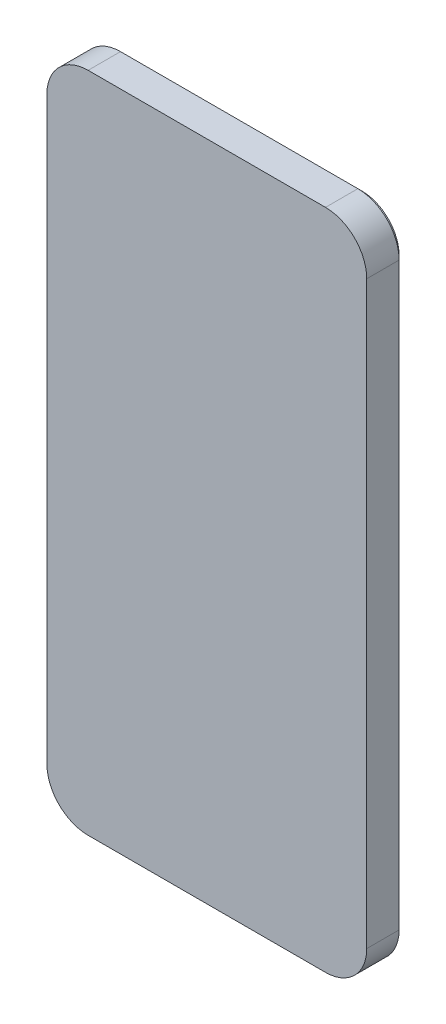
ISO-10303-21;
HEADER;
FILE_DESCRIPTION(('STEP AP214'),'2;1');
FILE_NAME('part.step','',(''),(''),'','','');
FILE_SCHEMA(('AUTOMOTIVE_DESIGN { 1 0 10303 214 1 1 1 1 }'));
ENDSEC;
DATA;
#1=APPLICATION_CONTEXT('core data for automotive mechanical design processes');
#2=APPLICATION_PROTOCOL_DEFINITION('international standard','automotive_design',2000,#1);
#3=PRODUCT_CONTEXT('',#1,'mechanical');
#4=PRODUCT('Part','Part','',(#3));
#5=PRODUCT_RELATED_PRODUCT_CATEGORY('part','',(#4));
#6=PRODUCT_DEFINITION_FORMATION('','',#4);
#7=PRODUCT_DEFINITION_CONTEXT('part definition',#1,'design');
#8=PRODUCT_DEFINITION('design','',#6,#7);
#9=PRODUCT_DEFINITION_SHAPE('','',#8);
#10=(LENGTH_UNIT() NAMED_UNIT(*) SI_UNIT(.MILLI.,.METRE.));
#11=(NAMED_UNIT(*) PLANE_ANGLE_UNIT() SI_UNIT($,.RADIAN.));
#12=(NAMED_UNIT(*) SI_UNIT($,.STERADIAN.) SOLID_ANGLE_UNIT());
#13=UNCERTAINTY_MEASURE_WITH_UNIT(LENGTH_MEASURE(1.E-05),#10,'distance_accuracy_value','');
#14=(GEOMETRIC_REPRESENTATION_CONTEXT(3) GLOBAL_UNCERTAINTY_ASSIGNED_CONTEXT((#13)) GLOBAL_UNIT_ASSIGNED_CONTEXT((#10,
#11,#12)) REPRESENTATION_CONTEXT('',''));
#15=CARTESIAN_POINT('',(0.,0.,0.));
#16=DIRECTION('',(0.,0.,1.));
#17=DIRECTION('',(1.,0.,0.));
#18=AXIS2_PLACEMENT_3D('',#15,#16,#17);
#19=CARTESIAN_POINT('',(42.7344857398579,18.2355513307985,-2.));
#20=DIRECTION('',(0.,0.,-1.));
#21=DIRECTION('',(-1.,0.,0.));
#22=AXIS2_PLACEMENT_3D('',#19,#20,#21);
#23=PLANE('',#22);
#24=DIRECTION('',(0.,1.,0.));
#25=VECTOR('',#24,1.);
#26=CARTESIAN_POINT('',(13.5344857398579,18.2355513307985,-2.));
#27=LINE('',#26,#25);
#28=CARTESIAN_POINT('',(13.5344857398577,-1.76444866920152,-2.));
#29=VERTEX_POINT('',#28);
#30=CARTESIAN_POINT('',(13.5344857398579,18.2355513307985,-2.));
#31=VERTEX_POINT('',#30);
#32=EDGE_CURVE('E361',#29,#31,#27,.T.);
#33=ORIENTED_EDGE('',*,*,#32,.T.);
#34=CARTESIAN_POINT('',(22.7344857398579,18.2355513307985,-2.));
#35=DIRECTION('',(0.,0.,-1.));
#36=DIRECTION('',(-1.,0.,0.));
#37=AXIS2_PLACEMENT_3D('',#34,#35,#36);
#38=CIRCLE('',#37,9.2);
#39=CARTESIAN_POINT('',(22.7344857398579,27.4355513307985,-2.));
#40=VERTEX_POINT('',#39);
#41=EDGE_CURVE('E363',#31,#40,#38,.T.);
#42=ORIENTED_EDGE('',*,*,#41,.T.);
#43=DIRECTION('',(1.,0.,0.));
#44=VECTOR('',#43,1.);
#45=CARTESIAN_POINT('',(42.7344857398579,27.4355513307985,-2.));
#46=LINE('',#45,#44);
#47=CARTESIAN_POINT('',(42.7344857398579,27.4355513307985,-2.));
#48=VERTEX_POINT('',#47);
#49=EDGE_CURVE('E349',#40,#48,#46,.T.);
#50=ORIENTED_EDGE('',*,*,#49,.T.);
#51=CARTESIAN_POINT('',(42.7344857398579,18.2355513307985,-2.));
#52=DIRECTION('',(0.,0.,-1.));
#53=DIRECTION('',(-1.,0.,0.));
#54=AXIS2_PLACEMENT_3D('',#51,#52,#53);
#55=CIRCLE('',#54,9.2);
#56=CARTESIAN_POINT('',(51.9344857398579,18.2355513307985,-2.));
#57=VERTEX_POINT('',#56);
#58=EDGE_CURVE('E351',#48,#57,#55,.T.);
#59=ORIENTED_EDGE('',*,*,#58,.T.);
#60=DIRECTION('',(0.,-1.,0.));
#61=VECTOR('',#60,1.);
#62=CARTESIAN_POINT('',(51.9344857398577,-1.7644486692015,-2.));
#63=LINE('',#62,#61);
#64=CARTESIAN_POINT('',(51.9344857398577,-1.76444866920151,-2.));
#65=VERTEX_POINT('',#64);
#66=EDGE_CURVE('E353',#57,#65,#63,.T.);
#67=ORIENTED_EDGE('',*,*,#66,.T.);
#68=CARTESIAN_POINT('',(42.7344857398577,-1.76444866920151,-2.));
#69=DIRECTION('',(0.,0.,-1.));
#70=DIRECTION('',(-1.,0.,0.));
#71=AXIS2_PLACEMENT_3D('',#68,#69,#70);
#72=CIRCLE('',#71,9.2);
#73=CARTESIAN_POINT('',(42.7344857398577,-10.9644486692015,-2.));
#74=VERTEX_POINT('',#73);
#75=EDGE_CURVE('E355',#65,#74,#72,.T.);
#76=ORIENTED_EDGE('',*,*,#75,.T.);
#77=DIRECTION('',(-1.,0.,0.));
#78=VECTOR('',#77,1.);
#79=CARTESIAN_POINT('',(22.7344857398577,-10.9644486692015,-2.));
#80=LINE('',#79,#78);
#81=CARTESIAN_POINT('',(22.7344857398577,-10.9644486692015,-2.));
#82=VERTEX_POINT('',#81);
#83=EDGE_CURVE('E357',#74,#82,#80,.T.);
#84=ORIENTED_EDGE('',*,*,#83,.T.);
#85=CARTESIAN_POINT('',(22.7344857398577,-1.76444866920151,-2.));
#86=DIRECTION('',(0.,0.,-1.));
#87=DIRECTION('',(-1.,0.,0.));
#88=AXIS2_PLACEMENT_3D('',#85,#86,#87);
#89=CIRCLE('',#88,9.2);
#90=EDGE_CURVE('E359',#82,#29,#89,.T.);
#91=ORIENTED_EDGE('',*,*,#90,.T.);
#92=EDGE_LOOP('',(#33,#42,#50,#59,#67,#76,#84,#91));
#93=FACE_BOUND('',#92,.T.);
#94=DIRECTION('',(0.,-1.,0.));
#95=VECTOR('',#94,1.);
#96=CARTESIAN_POINT('',(51.7344857398579,18.2355513307985,-2.));
#97=LINE('',#96,#95);
#98=CARTESIAN_POINT('',(51.7344857398579,18.2355513307985,-2.));
#99=VERTEX_POINT('',#98);
#100=CARTESIAN_POINT('',(51.7344857398577,-1.7644486692015,-2.));
#101=VERTEX_POINT('',#100);
#102=EDGE_CURVE('E404',#99,#101,#97,.T.);
#103=ORIENTED_EDGE('',*,*,#102,.F.);
#104=CARTESIAN_POINT('',(42.7344857398579,18.2355513307985,-2.));
#105=DIRECTION('',(0.,0.,-1.));
#106=DIRECTION('',(-1.,0.,0.));
#107=AXIS2_PLACEMENT_3D('',#104,#105,#106);
#108=CIRCLE('',#107,9.);
#109=CARTESIAN_POINT('',(42.7344857398579,27.2355513307985,-2.));
#110=VERTEX_POINT('',#109);
#111=EDGE_CURVE('E242',#110,#99,#108,.T.);
#112=ORIENTED_EDGE('',*,*,#111,.F.);
#113=DIRECTION('',(1.,0.,0.));
#114=VECTOR('',#113,1.);
#115=CARTESIAN_POINT('',(42.7344857398579,27.2355513307985,-2.));
#116=LINE('',#115,#114);
#117=CARTESIAN_POINT('',(22.7344857398579,27.2355513307985,-2.));
#118=VERTEX_POINT('',#117);
#119=EDGE_CURVE('E238',#118,#110,#116,.T.);
#120=ORIENTED_EDGE('',*,*,#119,.F.);
#121=CARTESIAN_POINT('',(22.7344857398579,18.2355513307985,-2.));
#122=DIRECTION('',(0.,0.,-1.));
#123=DIRECTION('',(-1.,0.,0.));
#124=AXIS2_PLACEMENT_3D('',#121,#122,#123);
#125=CIRCLE('',#124,8.99999999999998);
#126=CARTESIAN_POINT('',(13.7344857398579,18.2355513307985,-2.));
#127=VERTEX_POINT('',#126);
#128=EDGE_CURVE('E418',#127,#118,#125,.T.);
#129=ORIENTED_EDGE('',*,*,#128,.F.);
#130=DIRECTION('',(0.,1.,0.));
#131=VECTOR('',#130,1.);
#132=CARTESIAN_POINT('',(13.7344857398579,18.2355513307985,-2.));
#133=LINE('',#132,#131);
#134=CARTESIAN_POINT('',(13.7344857398579,-1.76444866920151,-2.));
#135=VERTEX_POINT('',#134);
#136=EDGE_CURVE('E416',#135,#127,#133,.T.);
#137=ORIENTED_EDGE('',*,*,#136,.F.);
#138=CARTESIAN_POINT('',(22.7344857398577,-1.76444866920151,-2.));
#139=DIRECTION('',(0.,0.,-1.));
#140=DIRECTION('',(-1.,0.,0.));
#141=AXIS2_PLACEMENT_3D('',#138,#139,#140);
#142=CIRCLE('',#141,8.99999999999987);
#143=CARTESIAN_POINT('',(22.7344857398577,-10.7644486692014,-2.));
#144=VERTEX_POINT('',#143);
#145=EDGE_CURVE('E414',#144,#135,#142,.T.);
#146=ORIENTED_EDGE('',*,*,#145,.F.);
#147=DIRECTION('',(-1.,0.,0.));
#148=VECTOR('',#147,1.);
#149=CARTESIAN_POINT('',(42.7344857398576,-10.7644486692015,-2.));
#150=LINE('',#149,#148);
#151=CARTESIAN_POINT('',(42.7344857398576,-10.7644486692015,-2.));
#152=VERTEX_POINT('',#151);
#153=EDGE_CURVE('E412',#152,#144,#150,.T.);
#154=ORIENTED_EDGE('',*,*,#153,.F.);
#155=CARTESIAN_POINT('',(42.7344857398576,-1.76444866920151,-2.));
#156=DIRECTION('',(0.,0.,-1.));
#157=DIRECTION('',(-1.,0.,0.));
#158=AXIS2_PLACEMENT_3D('',#155,#156,#157);
#159=CIRCLE('',#158,9.00000000000001);
#160=EDGE_CURVE('E406',#101,#152,#159,.T.);
#161=ORIENTED_EDGE('',*,*,#160,.F.);
#162=EDGE_LOOP('',(#103,#112,#120,#129,#137,#146,#154,#161));
#163=FACE_BOUND('',#162,.T.);
#164=ADVANCED_FACE('F33',(#93,#163),#23,.T.);
#165=CARTESIAN_POINT('',(0.,0.,0.));
#166=DIRECTION('',(0.,0.,1.));
#167=DIRECTION('',(1.,0.,0.));
#168=AXIS2_PLACEMENT_3D('',#165,#166,#167);
#169=PLANE('',#168);
#170=DIRECTION('',(0.,1.,0.));
#171=VECTOR('',#170,1.);
#172=CARTESIAN_POINT('',(54.7344857398579,30.2355513307985,0.));
#173=LINE('',#172,#171);
#174=CARTESIAN_POINT('',(54.7344857398579,-120.464448669201,0.));
#175=VERTEX_POINT('',#174);
#176=CARTESIAN_POINT('',(54.7344857398579,20.2355513307985,0.));
#177=VERTEX_POINT('',#176);
#178=EDGE_CURVE('E309',#175,#177,#173,.T.);
#179=ORIENTED_EDGE('',*,*,#178,.F.);
#180=CARTESIAN_POINT('',(44.7344857398579,-120.464448669201,0.));
#181=DIRECTION('',(0.,0.,1.));
#182=DIRECTION('',(1.,0.,0.));
#183=AXIS2_PLACEMENT_3D('',#180,#181,#182);
#184=CIRCLE('',#183,10.);
#185=CARTESIAN_POINT('',(44.7344857398579,-130.464448669201,0.));
#186=VERTEX_POINT('',#185);
#187=EDGE_CURVE('E324',#175,#186,#184,.F.);
#188=ORIENTED_EDGE('',*,*,#187,.T.);
#189=DIRECTION('',(1.,0.,0.));
#190=VECTOR('',#189,1.);
#191=CARTESIAN_POINT('',(-22.8455142601421,-130.464448669201,0.));
#192=LINE('',#191,#190);
#193=CARTESIAN_POINT('',(-12.8455142601421,-130.464448669201,0.));
#194=VERTEX_POINT('',#193);
#195=EDGE_CURVE('E306',#194,#186,#192,.T.);
#196=ORIENTED_EDGE('',*,*,#195,.F.);
#197=CARTESIAN_POINT('',(-12.8455142601421,-120.464448669201,0.));
#198=DIRECTION('',(0.,0.,1.));
#199=DIRECTION('',(1.,0.,0.));
#200=AXIS2_PLACEMENT_3D('',#197,#198,#199);
#201=CIRCLE('',#200,10.);
#202=CARTESIAN_POINT('',(-22.8455142601421,-120.464448669201,0.));
#203=VERTEX_POINT('',#202);
#204=EDGE_CURVE('E322',#194,#203,#201,.F.);
#205=ORIENTED_EDGE('',*,*,#204,.T.);
#206=DIRECTION('',(0.,-1.,0.));
#207=VECTOR('',#206,1.);
#208=CARTESIAN_POINT('',(-22.8455142601421,30.2355513307985,0.));
#209=LINE('',#208,#207);
#210=CARTESIAN_POINT('',(-22.8455142601421,20.2355513307985,0.));
#211=VERTEX_POINT('',#210);
#212=EDGE_CURVE('E289',#211,#203,#209,.T.);
#213=ORIENTED_EDGE('',*,*,#212,.F.);
#214=CARTESIAN_POINT('',(-12.8455142601421,20.2355513307985,0.));
#215=DIRECTION('',(0.,0.,1.));
#216=DIRECTION('',(1.,0.,0.));
#217=AXIS2_PLACEMENT_3D('',#214,#215,#216);
#218=CIRCLE('',#217,10.);
#219=CARTESIAN_POINT('',(-12.8455142601421,30.2355513307985,0.));
#220=VERTEX_POINT('',#219);
#221=EDGE_CURVE('E320',#211,#220,#218,.F.);
#222=ORIENTED_EDGE('',*,*,#221,.T.);
#223=DIRECTION('',(-1.,0.,0.));
#224=VECTOR('',#223,1.);
#225=CARTESIAN_POINT('',(-22.8455142601421,30.2355513307985,0.));
#226=LINE('',#225,#224);
#227=CARTESIAN_POINT('',(44.7344857398579,30.2355513307985,0.));
#228=VERTEX_POINT('',#227);
#229=EDGE_CURVE('E294',#228,#220,#226,.T.);
#230=ORIENTED_EDGE('',*,*,#229,.F.);
#231=CARTESIAN_POINT('',(44.7344857398579,20.2355513307985,0.));
#232=DIRECTION('',(0.,0.,1.));
#233=DIRECTION('',(1.,0.,0.));
#234=AXIS2_PLACEMENT_3D('',#231,#232,#233);
#235=CIRCLE('',#234,10.);
#236=EDGE_CURVE('E318',#228,#177,#235,.F.);
#237=ORIENTED_EDGE('',*,*,#236,.T.);
#238=EDGE_LOOP('',(#179,#188,#196,#205,#213,#222,#230,#237));
#239=FACE_BOUND('',#238,.T.);
#240=CARTESIAN_POINT('',(42.7344857398579,18.2355513307985,0.));
#241=DIRECTION('',(0.,0.,-1.));
#242=DIRECTION('',(-1.,0.,0.));
#243=AXIS2_PLACEMENT_3D('',#240,#241,#242);
#244=CIRCLE('',#243,10.);
#245=CARTESIAN_POINT('',(42.7344857398579,28.2355513307985,0.));
#246=VERTEX_POINT('',#245);
#247=CARTESIAN_POINT('',(52.7344857398579,18.2355513307985,0.));
#248=VERTEX_POINT('',#247);
#249=EDGE_CURVE('E244',#246,#248,#244,.T.);
#250=ORIENTED_EDGE('',*,*,#249,.F.);
#251=DIRECTION('',(1.,0.,0.));
#252=VECTOR('',#251,1.);
#253=CARTESIAN_POINT('',(42.7344857398579,28.2355513307985,0.));
#254=LINE('',#253,#252);
#255=CARTESIAN_POINT('',(22.7344857398579,28.2355513307985,0.));
#256=VERTEX_POINT('',#255);
#257=EDGE_CURVE('E270',#256,#246,#254,.T.);
#258=ORIENTED_EDGE('',*,*,#257,.F.);
#259=CARTESIAN_POINT('',(22.7344857398579,18.2355513307985,0.));
#260=DIRECTION('',(0.,0.,-1.));
#261=DIRECTION('',(-1.,0.,0.));
#262=AXIS2_PLACEMENT_3D('',#259,#260,#261);
#263=CIRCLE('',#262,10.);
#264=CARTESIAN_POINT('',(12.7344857398579,18.2355513307985,0.));
#265=VERTEX_POINT('',#264);
#266=EDGE_CURVE('E267',#265,#256,#263,.T.);
#267=ORIENTED_EDGE('',*,*,#266,.F.);
#268=DIRECTION('',(0.,1.,0.));
#269=VECTOR('',#268,1.);
#270=CARTESIAN_POINT('',(12.7344857398579,18.2355513307985,0.));
#271=LINE('',#270,#269);
#272=CARTESIAN_POINT('',(12.7344857398577,-1.76444866920151,0.));
#273=VERTEX_POINT('',#272);
#274=EDGE_CURVE('E264',#273,#265,#271,.T.);
#275=ORIENTED_EDGE('',*,*,#274,.F.);
#276=CARTESIAN_POINT('',(22.7344857398577,-1.76444866920151,0.));
#277=DIRECTION('',(0.,0.,-1.));
#278=DIRECTION('',(-1.,0.,0.));
#279=AXIS2_PLACEMENT_3D('',#276,#277,#278);
#280=CIRCLE('',#279,10.);
#281=CARTESIAN_POINT('',(22.7344857398577,-11.7644486692015,0.));
#282=VERTEX_POINT('',#281);
#283=EDGE_CURVE('E261',#282,#273,#280,.T.);
#284=ORIENTED_EDGE('',*,*,#283,.F.);
#285=DIRECTION('',(-1.,0.,0.));
#286=VECTOR('',#285,1.);
#287=CARTESIAN_POINT('',(42.7344857398577,-11.7644486692015,0.));
#288=LINE('',#287,#286);
#289=CARTESIAN_POINT('',(42.7344857398577,-11.7644486692015,0.));
#290=VERTEX_POINT('',#289);
#291=EDGE_CURVE('E258',#290,#282,#288,.T.);
#292=ORIENTED_EDGE('',*,*,#291,.F.);
#293=CARTESIAN_POINT('',(42.7344857398577,-1.76444866920151,0.));
#294=DIRECTION('',(0.,0.,-1.));
#295=DIRECTION('',(-1.,0.,0.));
#296=AXIS2_PLACEMENT_3D('',#293,#294,#295);
#297=CIRCLE('',#296,10.);
#298=CARTESIAN_POINT('',(52.7344857398577,-1.76444866920151,0.));
#299=VERTEX_POINT('',#298);
#300=EDGE_CURVE('E255',#299,#290,#297,.T.);
#301=ORIENTED_EDGE('',*,*,#300,.F.);
#302=DIRECTION('',(0.,-1.,0.));
#303=VECTOR('',#302,1.);
#304=CARTESIAN_POINT('',(52.7344857398579,18.2355513307985,0.));
#305=LINE('',#304,#303);
#306=EDGE_CURVE('E247',#248,#299,#305,.T.);
#307=ORIENTED_EDGE('',*,*,#306,.F.);
#308=EDGE_LOOP('',(#250,#258,#267,#275,#284,#292,#301,#307));
#309=FACE_BOUND('',#308,.T.);
#310=ADVANCED_FACE('F474',(#239,#309),#169,.F.);
#311=CARTESIAN_POINT('',(-22.8455142601421,30.2355513307985,7.85));
#312=DIRECTION('',(1.,0.,0.));
#313=DIRECTION('',(0.,1.,0.));
#314=AXIS2_PLACEMENT_3D('',#311,#312,#313);
#315=PLANE('',#314);
#316=ORIENTED_EDGE('',*,*,#212,.T.);
#317=DIRECTION('',(0.,0.,-1.));
#318=VECTOR('',#317,1.);
#319=CARTESIAN_POINT('',(-22.8455142601421,-120.464448669201,7.85));
#320=LINE('',#319,#318);
#321=CARTESIAN_POINT('',(-22.8455142601421,-120.464448669201,7.85));
#322=VERTEX_POINT('',#321);
#323=EDGE_CURVE('E342',#203,#322,#320,.F.);
#324=ORIENTED_EDGE('',*,*,#323,.T.);
#325=DIRECTION('',(0.,-1.,0.));
#326=VECTOR('',#325,1.);
#327=CARTESIAN_POINT('',(-22.8455142601421,30.2355513307985,7.85));
#328=LINE('',#327,#326);
#329=CARTESIAN_POINT('',(-22.8455142601421,20.2355513307985,7.85));
#330=VERTEX_POINT('',#329);
#331=EDGE_CURVE('E290',#330,#322,#328,.T.);
#332=ORIENTED_EDGE('',*,*,#331,.F.);
#333=DIRECTION('',(0.,0.,-1.));
#334=VECTOR('',#333,1.);
#335=CARTESIAN_POINT('',(-22.8455142601421,20.2355513307985,7.85));
#336=LINE('',#335,#334);
#337=EDGE_CURVE('E339',#330,#211,#336,.T.);
#338=ORIENTED_EDGE('',*,*,#337,.T.);
#339=EDGE_LOOP('',(#316,#324,#332,#338));
#340=FACE_BOUND('',#339,.T.);
#341=ADVANCED_FACE('F482',(#340),#315,.F.);
#342=CARTESIAN_POINT('',(-22.8455142601421,-130.464448669201,7.85));
#343=DIRECTION('',(0.,1.,0.));
#344=DIRECTION('',(0.,0.,1.));
#345=AXIS2_PLACEMENT_3D('',#342,#343,#344);
#346=PLANE('',#345);
#347=ORIENTED_EDGE('',*,*,#195,.T.);
#348=DIRECTION('',(0.,0.,-1.));
#349=VECTOR('',#348,1.);
#350=CARTESIAN_POINT('',(44.7344857398579,-130.464448669201,7.85));
#351=LINE('',#350,#349);
#352=CARTESIAN_POINT('',(44.7344857398579,-130.464448669201,7.85));
#353=VERTEX_POINT('',#352);
#354=EDGE_CURVE('E329',#186,#353,#351,.F.);
#355=ORIENTED_EDGE('',*,*,#354,.T.);
#356=DIRECTION('',(1.,0.,0.));
#357=VECTOR('',#356,1.);
#358=CARTESIAN_POINT('',(-22.8455142601421,-130.464448669201,7.85));
#359=LINE('',#358,#357);
#360=CARTESIAN_POINT('',(-12.8455142601421,-130.464448669201,7.85));
#361=VERTEX_POINT('',#360);
#362=EDGE_CURVE('E293',#361,#353,#359,.T.);
#363=ORIENTED_EDGE('',*,*,#362,.F.);
#364=DIRECTION('',(0.,0.,-1.));
#365=VECTOR('',#364,1.);
#366=CARTESIAN_POINT('',(-12.8455142601421,-130.464448669201,7.85));
#367=LINE('',#366,#365);
#368=EDGE_CURVE('E326',#361,#194,#367,.T.);
#369=ORIENTED_EDGE('',*,*,#368,.T.);
#370=EDGE_LOOP('',(#347,#355,#363,#369));
#371=FACE_BOUND('',#370,.T.);
#372=ADVANCED_FACE('F529',(#371),#346,.F.);
#373=CARTESIAN_POINT('',(54.7344857398579,30.2355513307985,7.85));
#374=DIRECTION('',(-1.,0.,0.));
#375=DIRECTION('',(0.,-1.,0.));
#376=AXIS2_PLACEMENT_3D('',#373,#374,#375);
#377=PLANE('',#376);
#378=DIRECTION('',(0.,1.,0.));
#379=VECTOR('',#378,1.);
#380=CARTESIAN_POINT('',(54.7344857398579,30.2355513307985,7.85));
#381=LINE('',#380,#379);
#382=CARTESIAN_POINT('',(54.7344857398579,-120.464448669201,7.85));
#383=VERTEX_POINT('',#382);
#384=CARTESIAN_POINT('',(54.7344857398579,20.2355513307985,7.85));
#385=VERTEX_POINT('',#384);
#386=EDGE_CURVE('E297',#383,#385,#381,.T.);
#387=ORIENTED_EDGE('',*,*,#386,.F.);
#388=DIRECTION('',(0.,0.,-1.));
#389=VECTOR('',#388,1.);
#390=CARTESIAN_POINT('',(54.7344857398579,-120.464448669201,7.85));
#391=LINE('',#390,#389);
#392=EDGE_CURVE('E315',#383,#175,#391,.T.);
#393=ORIENTED_EDGE('',*,*,#392,.T.);
#394=ORIENTED_EDGE('',*,*,#178,.T.);
#395=DIRECTION('',(0.,0.,-1.));
#396=VECTOR('',#395,1.);
#397=CARTESIAN_POINT('',(54.7344857398579,20.2355513307985,7.85));
#398=LINE('',#397,#396);
#399=EDGE_CURVE('E303',#177,#385,#398,.F.);
#400=ORIENTED_EDGE('',*,*,#399,.T.);
#401=EDGE_LOOP('',(#387,#393,#394,#400));
#402=FACE_BOUND('',#401,.T.);
#403=ADVANCED_FACE('F525',(#402),#377,.F.);
#404=CARTESIAN_POINT('',(-22.8455142601421,30.2355513307985,7.85));
#405=DIRECTION('',(0.,-1.,0.));
#406=DIRECTION('',(0.,0.,-1.));
#407=AXIS2_PLACEMENT_3D('',#404,#405,#406);
#408=PLANE('',#407);
#409=ORIENTED_EDGE('',*,*,#229,.T.);
#410=DIRECTION('',(0.,0.,-1.));
#411=VECTOR('',#410,1.);
#412=CARTESIAN_POINT('',(-12.8455142601421,30.2355513307985,7.85));
#413=LINE('',#412,#411);
#414=CARTESIAN_POINT('',(-12.8455142601421,30.2355513307985,7.85));
#415=VERTEX_POINT('',#414);
#416=EDGE_CURVE('E347',#220,#415,#413,.F.);
#417=ORIENTED_EDGE('',*,*,#416,.T.);
#418=DIRECTION('',(-1.,0.,0.));
#419=VECTOR('',#418,1.);
#420=CARTESIAN_POINT('',(-22.8455142601421,30.2355513307985,7.85));
#421=LINE('',#420,#419);
#422=CARTESIAN_POINT('',(44.7344857398579,30.2355513307985,7.85));
#423=VERTEX_POINT('',#422);
#424=EDGE_CURVE('E300',#423,#415,#421,.T.);
#425=ORIENTED_EDGE('',*,*,#424,.F.);
#426=DIRECTION('',(0.,0.,-1.));
#427=VECTOR('',#426,1.);
#428=CARTESIAN_POINT('',(44.7344857398579,30.2355513307985,7.85));
#429=LINE('',#428,#427);
#430=EDGE_CURVE('E344',#423,#228,#429,.T.);
#431=ORIENTED_EDGE('',*,*,#430,.T.);
#432=EDGE_LOOP('',(#409,#417,#425,#431));
#433=FACE_BOUND('',#432,.T.);
#434=ADVANCED_FACE('F520',(#433),#408,.F.);
#435=CARTESIAN_POINT('',(0.,0.,7.85));
#436=DIRECTION('',(0.,0.,1.));
#437=DIRECTION('',(1.,0.,0.));
#438=AXIS2_PLACEMENT_3D('',#435,#436,#437);
#439=PLANE('',#438);
#440=ORIENTED_EDGE('',*,*,#362,.T.);
#441=CARTESIAN_POINT('',(44.7344857398579,-120.464448669201,7.85));
#442=DIRECTION('',(0.,0.,1.));
#443=DIRECTION('',(1.,0.,0.));
#444=AXIS2_PLACEMENT_3D('',#441,#442,#443);
#445=CIRCLE('',#444,10.);
#446=EDGE_CURVE('E337',#353,#383,#445,.T.);
#447=ORIENTED_EDGE('',*,*,#446,.T.);
#448=ORIENTED_EDGE('',*,*,#386,.T.);
#449=CARTESIAN_POINT('',(44.7344857398579,20.2355513307985,7.85));
#450=DIRECTION('',(0.,0.,1.));
#451=DIRECTION('',(1.,0.,0.));
#452=AXIS2_PLACEMENT_3D('',#449,#450,#451);
#453=CIRCLE('',#452,10.);
#454=EDGE_CURVE('E331',#385,#423,#453,.T.);
#455=ORIENTED_EDGE('',*,*,#454,.T.);
#456=ORIENTED_EDGE('',*,*,#424,.T.);
#457=CARTESIAN_POINT('',(-12.8455142601421,20.2355513307985,7.85));
#458=DIRECTION('',(0.,0.,1.));
#459=DIRECTION('',(1.,0.,0.));
#460=AXIS2_PLACEMENT_3D('',#457,#458,#459);
#461=CIRCLE('',#460,10.);
#462=EDGE_CURVE('E333',#415,#330,#461,.T.);
#463=ORIENTED_EDGE('',*,*,#462,.T.);
#464=ORIENTED_EDGE('',*,*,#331,.T.);
#465=CARTESIAN_POINT('',(-12.8455142601421,-120.464448669201,7.85));
#466=DIRECTION('',(0.,0.,1.));
#467=DIRECTION('',(1.,0.,0.));
#468=AXIS2_PLACEMENT_3D('',#465,#466,#467);
#469=CIRCLE('',#468,10.);
#470=EDGE_CURVE('E335',#322,#361,#469,.T.);
#471=ORIENTED_EDGE('',*,*,#470,.T.);
#472=EDGE_LOOP('',(#440,#447,#448,#455,#456,#463,#464,#471));
#473=FACE_BOUND('',#472,.T.);
#474=ADVANCED_FACE('F517',(#473),#439,.T.);
#475=CARTESIAN_POINT('',(44.7344857398579,-120.464448669201,7.85));
#476=DIRECTION('',(0.,0.,-1.));
#477=DIRECTION('',(-1.,0.,0.));
#478=AXIS2_PLACEMENT_3D('',#475,#476,#477);
#479=CYLINDRICAL_SURFACE('',#478,10.);
#480=ORIENTED_EDGE('',*,*,#446,.F.);
#481=ORIENTED_EDGE('',*,*,#354,.F.);
#482=ORIENTED_EDGE('',*,*,#187,.F.);
#483=ORIENTED_EDGE('',*,*,#392,.F.);
#484=EDGE_LOOP('',(#480,#481,#482,#483));
#485=FACE_BOUND('',#484,.T.);
#486=ADVANCED_FACE('F519',(#485),#479,.T.);
#487=CARTESIAN_POINT('',(-12.8455142601421,-120.464448669201,7.85));
#488=DIRECTION('',(0.,0.,-1.));
#489=DIRECTION('',(-1.,0.,0.));
#490=AXIS2_PLACEMENT_3D('',#487,#488,#489);
#491=CYLINDRICAL_SURFACE('',#490,10.);
#492=ORIENTED_EDGE('',*,*,#470,.F.);
#493=ORIENTED_EDGE('',*,*,#323,.F.);
#494=ORIENTED_EDGE('',*,*,#204,.F.);
#495=ORIENTED_EDGE('',*,*,#368,.F.);
#496=EDGE_LOOP('',(#492,#493,#494,#495));
#497=FACE_BOUND('',#496,.T.);
#498=ADVANCED_FACE('F539',(#497),#491,.T.);
#499=CARTESIAN_POINT('',(-12.8455142601421,20.2355513307985,7.85));
#500=DIRECTION('',(0.,0.,-1.));
#501=DIRECTION('',(-1.,0.,0.));
#502=AXIS2_PLACEMENT_3D('',#499,#500,#501);
#503=CYLINDRICAL_SURFACE('',#502,10.);
#504=ORIENTED_EDGE('',*,*,#462,.F.);
#505=ORIENTED_EDGE('',*,*,#416,.F.);
#506=ORIENTED_EDGE('',*,*,#221,.F.);
#507=ORIENTED_EDGE('',*,*,#337,.F.);
#508=EDGE_LOOP('',(#504,#505,#506,#507));
#509=FACE_BOUND('',#508,.T.);
#510=ADVANCED_FACE('F543',(#509),#503,.T.);
#511=CARTESIAN_POINT('',(44.7344857398579,20.2355513307985,7.85));
#512=DIRECTION('',(0.,0.,-1.));
#513=DIRECTION('',(-1.,0.,0.));
#514=AXIS2_PLACEMENT_3D('',#511,#512,#513);
#515=CYLINDRICAL_SURFACE('',#514,10.);
#516=ORIENTED_EDGE('',*,*,#454,.F.);
#517=ORIENTED_EDGE('',*,*,#399,.F.);
#518=ORIENTED_EDGE('',*,*,#236,.F.);
#519=ORIENTED_EDGE('',*,*,#430,.F.);
#520=EDGE_LOOP('',(#516,#517,#518,#519));
#521=FACE_BOUND('',#520,.T.);
#522=ADVANCED_FACE('F516',(#521),#515,.T.);
#523=CARTESIAN_POINT('',(42.7344857398579,18.2355513307985,-2.));
#524=DIRECTION('',(0.,0.,1.));
#525=DIRECTION('',(1.,0.,0.));
#526=AXIS2_PLACEMENT_3D('',#523,#524,#525);
#527=CYLINDRICAL_SURFACE('',#526,10.);
#528=DIRECTION('',(0.,0.,1.));
#529=VECTOR('',#528,1.);
#530=CARTESIAN_POINT('',(52.7344857398579,18.2355513307985,-2.));
#531=LINE('',#530,#529);
#532=CARTESIAN_POINT('',(52.7344857398579,18.2355513307985,-1.2));
#533=VERTEX_POINT('',#532);
#534=EDGE_CURVE('E287',#533,#248,#531,.T.);
#535=ORIENTED_EDGE('',*,*,#534,.F.);
#536=CARTESIAN_POINT('',(42.7344857398579,18.2355513307985,-1.2));
#537=DIRECTION('',(0.,0.,-1.));
#538=DIRECTION('',(-1.,0.,0.));
#539=AXIS2_PLACEMENT_3D('',#536,#537,#538);
#540=CIRCLE('',#539,10.);
#541=CARTESIAN_POINT('',(42.7344857398579,28.2355513307985,-1.2));
#542=VERTEX_POINT('',#541);
#543=EDGE_CURVE('E42',#533,#542,#540,.F.);
#544=ORIENTED_EDGE('',*,*,#543,.T.);
#545=DIRECTION('',(0.,0.,1.));
#546=VECTOR('',#545,1.);
#547=CARTESIAN_POINT('',(42.7344857398579,28.2355513307985,-2.));
#548=LINE('',#547,#546);
#549=EDGE_CURVE('E273',#542,#246,#548,.T.);
#550=ORIENTED_EDGE('',*,*,#549,.T.);
#551=ORIENTED_EDGE('',*,*,#249,.T.);
#552=EDGE_LOOP('',(#535,#544,#550,#551));
#553=FACE_BOUND('',#552,.T.);
#554=ADVANCED_FACE('F514',(#553),#527,.T.);
#555=CARTESIAN_POINT('',(52.7344857398579,18.2355513307985,-2.));
#556=DIRECTION('',(-1.,0.,0.));
#557=DIRECTION('',(0.,-1.,0.));
#558=AXIS2_PLACEMENT_3D('',#555,#556,#557);
#559=PLANE('',#558);
#560=DIRECTION('',(0.,0.,1.));
#561=VECTOR('',#560,1.);
#562=CARTESIAN_POINT('',(52.7344857398577,-1.76444866920151,-2.));
#563=LINE('',#562,#561);
#564=CARTESIAN_POINT('',(52.7344857398577,-1.76444866920151,-1.2));
#565=VERTEX_POINT('',#564);
#566=EDGE_CURVE('E285',#565,#299,#563,.T.);
#567=ORIENTED_EDGE('',*,*,#566,.F.);
#568=DIRECTION('',(0.,-1.,0.));
#569=VECTOR('',#568,1.);
#570=CARTESIAN_POINT('',(52.7344857398579,18.2355513307985,-1.2));
#571=LINE('',#570,#569);
#572=EDGE_CURVE('E57',#565,#533,#571,.F.);
#573=ORIENTED_EDGE('',*,*,#572,.T.);
#574=ORIENTED_EDGE('',*,*,#534,.T.);
#575=ORIENTED_EDGE('',*,*,#306,.T.);
#576=EDGE_LOOP('',(#567,#573,#574,#575));
#577=FACE_BOUND('',#576,.T.);
#578=ADVANCED_FACE('F510',(#577),#559,.F.);
#579=CARTESIAN_POINT('',(42.7344857398577,-1.76444866920151,-2.));
#580=DIRECTION('',(0.,0.,1.));
#581=DIRECTION('',(1.,0.,0.));
#582=AXIS2_PLACEMENT_3D('',#579,#580,#581);
#583=CYLINDRICAL_SURFACE('',#582,10.);
#584=DIRECTION('',(0.,0.,1.));
#585=VECTOR('',#584,1.);
#586=CARTESIAN_POINT('',(42.7344857398577,-11.7644486692015,-2.));
#587=LINE('',#586,#585);
#588=CARTESIAN_POINT('',(42.7344857398577,-11.7644486692015,-1.2));
#589=VERTEX_POINT('',#588);
#590=EDGE_CURVE('E283',#589,#290,#587,.T.);
#591=ORIENTED_EDGE('',*,*,#590,.F.);
#592=CARTESIAN_POINT('',(42.7344857398577,-1.76444866920151,-1.2));
#593=DIRECTION('',(0.,0.,-1.));
#594=DIRECTION('',(-1.,0.,0.));
#595=AXIS2_PLACEMENT_3D('',#592,#593,#594);
#596=CIRCLE('',#595,10.);
#597=EDGE_CURVE('E375',#589,#565,#596,.F.);
#598=ORIENTED_EDGE('',*,*,#597,.T.);
#599=ORIENTED_EDGE('',*,*,#566,.T.);
#600=ORIENTED_EDGE('',*,*,#300,.T.);
#601=EDGE_LOOP('',(#591,#598,#599,#600));
#602=FACE_BOUND('',#601,.T.);
#603=ADVANCED_FACE('F506',(#602),#583,.T.);
#604=CARTESIAN_POINT('',(42.7344857398577,-11.7644486692015,-2.));
#605=DIRECTION('',(0.,1.,0.));
#606=DIRECTION('',(0.,0.,1.));
#607=AXIS2_PLACEMENT_3D('',#604,#605,#606);
#608=PLANE('',#607);
#609=DIRECTION('',(0.,0.,1.));
#610=VECTOR('',#609,1.);
#611=CARTESIAN_POINT('',(22.7344857398577,-11.7644486692015,-2.));
#612=LINE('',#611,#610);
#613=CARTESIAN_POINT('',(22.7344857398577,-11.7644486692015,-1.2));
#614=VERTEX_POINT('',#613);
#615=EDGE_CURVE('E281',#614,#282,#612,.T.);
#616=ORIENTED_EDGE('',*,*,#615,.F.);
#617=DIRECTION('',(-1.,0.,0.));
#618=VECTOR('',#617,1.);
#619=CARTESIAN_POINT('',(42.7344857398577,-11.7644486692015,-1.2));
#620=LINE('',#619,#618);
#621=EDGE_CURVE('E373',#614,#589,#620,.F.);
#622=ORIENTED_EDGE('',*,*,#621,.T.);
#623=ORIENTED_EDGE('',*,*,#590,.T.);
#624=ORIENTED_EDGE('',*,*,#291,.T.);
#625=EDGE_LOOP('',(#616,#622,#623,#624));
#626=FACE_BOUND('',#625,.T.);
#627=ADVANCED_FACE('F502',(#626),#608,.F.);
#628=CARTESIAN_POINT('',(22.7344857398577,-1.76444866920151,-2.));
#629=DIRECTION('',(0.,0.,1.));
#630=DIRECTION('',(1.,0.,0.));
#631=AXIS2_PLACEMENT_3D('',#628,#629,#630);
#632=CYLINDRICAL_SURFACE('',#631,10.);
#633=DIRECTION('',(0.,0.,1.));
#634=VECTOR('',#633,1.);
#635=CARTESIAN_POINT('',(12.7344857398577,-1.76444866920151,-2.));
#636=LINE('',#635,#634);
#637=CARTESIAN_POINT('',(12.7344857398577,-1.76444866920151,-1.2));
#638=VERTEX_POINT('',#637);
#639=EDGE_CURVE('E279',#638,#273,#636,.T.);
#640=ORIENTED_EDGE('',*,*,#639,.F.);
#641=CARTESIAN_POINT('',(22.7344857398577,-1.76444866920151,-1.2));
#642=DIRECTION('',(0.,0.,-1.));
#643=DIRECTION('',(-1.,0.,0.));
#644=AXIS2_PLACEMENT_3D('',#641,#642,#643);
#645=CIRCLE('',#644,10.);
#646=EDGE_CURVE('E371',#638,#614,#645,.F.);
#647=ORIENTED_EDGE('',*,*,#646,.T.);
#648=ORIENTED_EDGE('',*,*,#615,.T.);
#649=ORIENTED_EDGE('',*,*,#283,.T.);
#650=EDGE_LOOP('',(#640,#647,#648,#649));
#651=FACE_BOUND('',#650,.T.);
#652=ADVANCED_FACE('F498',(#651),#632,.T.);
#653=CARTESIAN_POINT('',(12.7344857398579,18.2355513307985,-2.));
#654=DIRECTION('',(1.,0.,0.));
#655=DIRECTION('',(0.,1.,0.));
#656=AXIS2_PLACEMENT_3D('',#653,#654,#655);
#657=PLANE('',#656);
#658=DIRECTION('',(0.,0.,1.));
#659=VECTOR('',#658,1.);
#660=CARTESIAN_POINT('',(12.7344857398579,18.2355513307985,-2.));
#661=LINE('',#660,#659);
#662=CARTESIAN_POINT('',(12.7344857398579,18.2355513307985,-1.2));
#663=VERTEX_POINT('',#662);
#664=EDGE_CURVE('E277',#663,#265,#661,.T.);
#665=ORIENTED_EDGE('',*,*,#664,.F.);
#666=DIRECTION('',(0.,1.,0.));
#667=VECTOR('',#666,1.);
#668=CARTESIAN_POINT('',(12.7344857398577,-1.76444866920151,-1.2));
#669=LINE('',#668,#667);
#670=EDGE_CURVE('E369',#663,#638,#669,.F.);
#671=ORIENTED_EDGE('',*,*,#670,.T.);
#672=ORIENTED_EDGE('',*,*,#639,.T.);
#673=ORIENTED_EDGE('',*,*,#274,.T.);
#674=EDGE_LOOP('',(#665,#671,#672,#673));
#675=FACE_BOUND('',#674,.T.);
#676=ADVANCED_FACE('F494',(#675),#657,.F.);
#677=CARTESIAN_POINT('',(22.7344857398579,18.2355513307985,-2.));
#678=DIRECTION('',(0.,0.,1.));
#679=DIRECTION('',(1.,0.,0.));
#680=AXIS2_PLACEMENT_3D('',#677,#678,#679);
#681=CYLINDRICAL_SURFACE('',#680,10.);
#682=DIRECTION('',(0.,0.,1.));
#683=VECTOR('',#682,1.);
#684=CARTESIAN_POINT('',(22.7344857398579,28.2355513307985,-2.));
#685=LINE('',#684,#683);
#686=CARTESIAN_POINT('',(22.7344857398579,28.2355513307985,-1.2));
#687=VERTEX_POINT('',#686);
#688=EDGE_CURVE('E275',#687,#256,#685,.T.);
#689=ORIENTED_EDGE('',*,*,#688,.F.);
#690=CARTESIAN_POINT('',(22.7344857398579,18.2355513307985,-1.2));
#691=DIRECTION('',(0.,0.,-1.));
#692=DIRECTION('',(-1.,0.,0.));
#693=AXIS2_PLACEMENT_3D('',#690,#691,#692);
#694=CIRCLE('',#693,10.);
#695=EDGE_CURVE('E366',#687,#663,#694,.F.);
#696=ORIENTED_EDGE('',*,*,#695,.T.);
#697=ORIENTED_EDGE('',*,*,#664,.T.);
#698=ORIENTED_EDGE('',*,*,#266,.T.);
#699=EDGE_LOOP('',(#689,#696,#697,#698));
#700=FACE_BOUND('',#699,.T.);
#701=ADVANCED_FACE('F490',(#700),#681,.T.);
#702=CARTESIAN_POINT('',(42.7344857398579,28.2355513307985,-2.));
#703=DIRECTION('',(0.,-1.,0.));
#704=DIRECTION('',(0.,0.,-1.));
#705=AXIS2_PLACEMENT_3D('',#702,#703,#704);
#706=PLANE('',#705);
#707=ORIENTED_EDGE('',*,*,#549,.F.);
#708=DIRECTION('',(1.,0.,0.));
#709=VECTOR('',#708,1.);
#710=CARTESIAN_POINT('',(22.7344857398579,28.2355513307985,-1.2));
#711=LINE('',#710,#709);
#712=EDGE_CURVE('E11',#542,#687,#711,.F.);
#713=ORIENTED_EDGE('',*,*,#712,.T.);
#714=ORIENTED_EDGE('',*,*,#688,.T.);
#715=ORIENTED_EDGE('',*,*,#257,.T.);
#716=EDGE_LOOP('',(#707,#713,#714,#715));
#717=FACE_BOUND('',#716,.T.);
#718=ADVANCED_FACE('F487',(#717),#706,.F.);
#719=CARTESIAN_POINT('',(42.7344857398579,18.2355513307985,-3.));
#720=DIRECTION('',(0.,0.,1.));
#721=DIRECTION('',(1.,0.,0.));
#722=AXIS2_PLACEMENT_3D('',#719,#720,#721);
#723=CYLINDRICAL_SURFACE('',#722,9.);
#724=ORIENTED_EDGE('',*,*,#111,.T.);
#725=DIRECTION('',(0.,0.,1.));
#726=VECTOR('',#725,1.);
#727=CARTESIAN_POINT('',(51.7344857398579,18.2355513307985,-3.));
#728=LINE('',#727,#726);
#729=CARTESIAN_POINT('',(51.7344857398579,18.2355513307985,-3.));
#730=VERTEX_POINT('',#729);
#731=EDGE_CURVE('E222',#730,#99,#728,.T.);
#732=ORIENTED_EDGE('',*,*,#731,.F.);
#733=CARTESIAN_POINT('',(42.7344857398579,18.2355513307985,-3.));
#734=DIRECTION('',(0.,0.,-1.));
#735=DIRECTION('',(-1.,0.,0.));
#736=AXIS2_PLACEMENT_3D('',#733,#734,#735);
#737=CIRCLE('',#736,9.);
#738=CARTESIAN_POINT('',(42.7344857398579,27.2355513307985,-3.));
#739=VERTEX_POINT('',#738);
#740=EDGE_CURVE('E229',#739,#730,#737,.T.);
#741=ORIENTED_EDGE('',*,*,#740,.F.);
#742=DIRECTION('',(0.,0.,1.));
#743=VECTOR('',#742,1.);
#744=CARTESIAN_POINT('',(42.7344857398579,27.2355513307985,-3.));
#745=LINE('',#744,#743);
#746=EDGE_CURVE('E422',#739,#110,#745,.T.);
#747=ORIENTED_EDGE('',*,*,#746,.T.);
#748=EDGE_LOOP('',(#724,#732,#741,#747));
#749=FACE_BOUND('',#748,.T.);
#750=ADVANCED_FACE('F240',(#749),#723,.T.);
#751=CARTESIAN_POINT('',(51.7344857398579,18.2355513307985,-3.));
#752=DIRECTION('',(-1.,0.,0.));
#753=DIRECTION('',(0.,-1.,0.));
#754=AXIS2_PLACEMENT_3D('',#751,#752,#753);
#755=PLANE('',#754);
#756=ORIENTED_EDGE('',*,*,#102,.T.);
#757=DIRECTION('',(0.,0.,1.));
#758=VECTOR('',#757,1.);
#759=CARTESIAN_POINT('',(51.7344857398577,-1.7644486692015,-3.));
#760=LINE('',#759,#758);
#761=CARTESIAN_POINT('',(51.7344857398577,-1.7644486692015,-3.));
#762=VERTEX_POINT('',#761);
#763=EDGE_CURVE('E225',#762,#101,#760,.T.);
#764=ORIENTED_EDGE('',*,*,#763,.F.);
#765=DIRECTION('',(0.,-1.,0.));
#766=VECTOR('',#765,1.);
#767=CARTESIAN_POINT('',(51.7344857398579,18.2355513307985,-3.));
#768=LINE('',#767,#766);
#769=EDGE_CURVE('E218',#730,#762,#768,.T.);
#770=ORIENTED_EDGE('',*,*,#769,.F.);
#771=ORIENTED_EDGE('',*,*,#731,.T.);
#772=EDGE_LOOP('',(#756,#764,#770,#771));
#773=FACE_BOUND('',#772,.T.);
#774=ADVANCED_FACE('F220',(#773),#755,.F.);
#775=CARTESIAN_POINT('',(42.7344857398576,-1.76444866920151,-3.));
#776=DIRECTION('',(0.,0.,1.));
#777=DIRECTION('',(1.,0.,0.));
#778=AXIS2_PLACEMENT_3D('',#775,#776,#777);
#779=CYLINDRICAL_SURFACE('',#778,9.00000000000001);
#780=ORIENTED_EDGE('',*,*,#160,.T.);
#781=DIRECTION('',(0.,0.,1.));
#782=VECTOR('',#781,1.);
#783=CARTESIAN_POINT('',(42.7344857398576,-10.7644486692015,-3.));
#784=LINE('',#783,#782);
#785=CARTESIAN_POINT('',(42.7344857398576,-10.7644486692015,-3.));
#786=VERTEX_POINT('',#785);
#787=EDGE_CURVE('E249',#786,#152,#784,.T.);
#788=ORIENTED_EDGE('',*,*,#787,.F.);
#789=CARTESIAN_POINT('',(42.7344857398576,-1.76444866920151,-3.));
#790=DIRECTION('',(0.,0.,-1.));
#791=DIRECTION('',(-1.,0.,0.));
#792=AXIS2_PLACEMENT_3D('',#789,#790,#791);
#793=CIRCLE('',#792,9.00000000000001);
#794=EDGE_CURVE('E228',#762,#786,#793,.T.);
#795=ORIENTED_EDGE('',*,*,#794,.F.);
#796=ORIENTED_EDGE('',*,*,#763,.T.);
#797=EDGE_LOOP('',(#780,#788,#795,#796));
#798=FACE_BOUND('',#797,.T.);
#799=ADVANCED_FACE('F464',(#798),#779,.T.);
#800=CARTESIAN_POINT('',(42.7344857398576,-10.7644486692015,-3.));
#801=DIRECTION('',(0.,1.,0.));
#802=DIRECTION('',(-1.,0.,0.));
#803=AXIS2_PLACEMENT_3D('',#800,#801,#802);
#804=PLANE('',#803);
#805=ORIENTED_EDGE('',*,*,#153,.T.);
#806=DIRECTION('',(0.,0.,1.));
#807=VECTOR('',#806,1.);
#808=CARTESIAN_POINT('',(22.7344857398577,-10.7644486692014,-3.));
#809=LINE('',#808,#807);
#810=CARTESIAN_POINT('',(22.7344857398577,-10.7644486692014,-3.));
#811=VERTEX_POINT('',#810);
#812=EDGE_CURVE('E432',#811,#144,#809,.T.);
#813=ORIENTED_EDGE('',*,*,#812,.F.);
#814=DIRECTION('',(-1.,0.,0.));
#815=VECTOR('',#814,1.);
#816=CARTESIAN_POINT('',(42.7344857398576,-10.7644486692015,-3.));
#817=LINE('',#816,#815);
#818=EDGE_CURVE('E441',#786,#811,#817,.T.);
#819=ORIENTED_EDGE('',*,*,#818,.F.);
#820=ORIENTED_EDGE('',*,*,#787,.T.);
#821=EDGE_LOOP('',(#805,#813,#819,#820));
#822=FACE_BOUND('',#821,.T.);
#823=ADVANCED_FACE('F439',(#822),#804,.F.);
#824=CARTESIAN_POINT('',(22.7344857398577,-1.76444866920151,-3.));
#825=DIRECTION('',(0.,0.,1.));
#826=DIRECTION('',(1.,0.,0.));
#827=AXIS2_PLACEMENT_3D('',#824,#825,#826);
#828=CYLINDRICAL_SURFACE('',#827,8.99999999999987);
#829=ORIENTED_EDGE('',*,*,#145,.T.);
#830=DIRECTION('',(0.,0.,1.));
#831=VECTOR('',#830,1.);
#832=CARTESIAN_POINT('',(13.7344857398579,-1.76444866920151,-3.));
#833=LINE('',#832,#831);
#834=CARTESIAN_POINT('',(13.7344857398579,-1.76444866920151,-3.));
#835=VERTEX_POINT('',#834);
#836=EDGE_CURVE('E429',#835,#135,#833,.T.);
#837=ORIENTED_EDGE('',*,*,#836,.F.);
#838=CARTESIAN_POINT('',(22.7344857398577,-1.76444866920151,-3.));
#839=DIRECTION('',(0.,0.,-1.));
#840=DIRECTION('',(-1.,0.,0.));
#841=AXIS2_PLACEMENT_3D('',#838,#839,#840);
#842=CIRCLE('',#841,8.99999999999987);
#843=EDGE_CURVE('E459',#811,#835,#842,.T.);
#844=ORIENTED_EDGE('',*,*,#843,.F.);
#845=ORIENTED_EDGE('',*,*,#812,.T.);
#846=EDGE_LOOP('',(#829,#837,#844,#845));
#847=FACE_BOUND('',#846,.T.);
#848=ADVANCED_FACE('F450',(#847),#828,.T.);
#849=CARTESIAN_POINT('',(13.7344857398579,18.2355513307985,-3.));
#850=DIRECTION('',(1.,0.,0.));
#851=DIRECTION('',(0.,1.,0.));
#852=AXIS2_PLACEMENT_3D('',#849,#850,#851);
#853=PLANE('',#852);
#854=ORIENTED_EDGE('',*,*,#136,.T.);
#855=DIRECTION('',(0.,0.,1.));
#856=VECTOR('',#855,1.);
#857=CARTESIAN_POINT('',(13.7344857398579,18.2355513307985,-3.));
#858=LINE('',#857,#856);
#859=CARTESIAN_POINT('',(13.7344857398579,18.2355513307985,-3.));
#860=VERTEX_POINT('',#859);
#861=EDGE_CURVE('E426',#860,#127,#858,.T.);
#862=ORIENTED_EDGE('',*,*,#861,.F.);
#863=DIRECTION('',(0.,1.,0.));
#864=VECTOR('',#863,1.);
#865=CARTESIAN_POINT('',(13.7344857398579,18.2355513307985,-3.));
#866=LINE('',#865,#864);
#867=EDGE_CURVE('E456',#835,#860,#866,.T.);
#868=ORIENTED_EDGE('',*,*,#867,.F.);
#869=ORIENTED_EDGE('',*,*,#836,.T.);
#870=EDGE_LOOP('',(#854,#862,#868,#869));
#871=FACE_BOUND('',#870,.T.);
#872=ADVANCED_FACE('F454',(#871),#853,.F.);
#873=CARTESIAN_POINT('',(22.7344857398579,18.2355513307985,-3.));
#874=DIRECTION('',(0.,0.,1.));
#875=DIRECTION('',(1.,0.,0.));
#876=AXIS2_PLACEMENT_3D('',#873,#874,#875);
#877=CYLINDRICAL_SURFACE('',#876,8.99999999999998);
#878=ORIENTED_EDGE('',*,*,#128,.T.);
#879=DIRECTION('',(0.,0.,1.));
#880=VECTOR('',#879,1.);
#881=CARTESIAN_POINT('',(22.7344857398579,27.2355513307985,-3.));
#882=LINE('',#881,#880);
#883=CARTESIAN_POINT('',(22.7344857398579,27.2355513307985,-3.));
#884=VERTEX_POINT('',#883);
#885=EDGE_CURVE('E424',#884,#118,#882,.T.);
#886=ORIENTED_EDGE('',*,*,#885,.F.);
#887=CARTESIAN_POINT('',(22.7344857398579,18.2355513307985,-3.));
#888=DIRECTION('',(0.,0.,-1.));
#889=DIRECTION('',(-1.,0.,0.));
#890=AXIS2_PLACEMENT_3D('',#887,#888,#889);
#891=CIRCLE('',#890,8.99999999999998);
#892=EDGE_CURVE('E458',#860,#884,#891,.T.);
#893=ORIENTED_EDGE('',*,*,#892,.F.);
#894=ORIENTED_EDGE('',*,*,#861,.T.);
#895=EDGE_LOOP('',(#878,#886,#893,#894));
#896=FACE_BOUND('',#895,.T.);
#897=ADVANCED_FACE('F617',(#896),#877,.T.);
#898=CARTESIAN_POINT('',(42.7344857398579,27.2355513307985,-3.));
#899=DIRECTION('',(0.,-1.,0.));
#900=DIRECTION('',(0.,0.,-1.));
#901=AXIS2_PLACEMENT_3D('',#898,#899,#900);
#902=PLANE('',#901);
#903=ORIENTED_EDGE('',*,*,#119,.T.);
#904=ORIENTED_EDGE('',*,*,#746,.F.);
#905=DIRECTION('',(1.,0.,0.));
#906=VECTOR('',#905,1.);
#907=CARTESIAN_POINT('',(42.7344857398579,27.2355513307985,-3.));
#908=LINE('',#907,#906);
#909=EDGE_CURVE('E234',#884,#739,#908,.T.);
#910=ORIENTED_EDGE('',*,*,#909,.F.);
#911=ORIENTED_EDGE('',*,*,#885,.T.);
#912=EDGE_LOOP('',(#903,#904,#910,#911));
#913=FACE_BOUND('',#912,.T.);
#914=ADVANCED_FACE('F582',(#913),#902,.F.);
#915=CARTESIAN_POINT('',(42.7344857398579,18.2355513307985,-3.));
#916=DIRECTION('',(0.,0.,-1.));
#917=DIRECTION('',(-1.,0.,0.));
#918=AXIS2_PLACEMENT_3D('',#915,#916,#917);
#919=PLANE('',#918);
#920=ORIENTED_EDGE('',*,*,#740,.T.);
#921=ORIENTED_EDGE('',*,*,#769,.T.);
#922=ORIENTED_EDGE('',*,*,#794,.T.);
#923=ORIENTED_EDGE('',*,*,#818,.T.);
#924=ORIENTED_EDGE('',*,*,#843,.T.);
#925=ORIENTED_EDGE('',*,*,#867,.T.);
#926=ORIENTED_EDGE('',*,*,#892,.T.);
#927=ORIENTED_EDGE('',*,*,#909,.T.);
#928=EDGE_LOOP('',(#920,#921,#922,#923,#924,#925,#926,#927));
#929=FACE_BOUND('',#928,.T.);
#930=ADVANCED_FACE('F232',(#929),#919,.T.);
#931=CARTESIAN_POINT('',(42.7344857398577,-1.76444866920151,-1.2));
#932=DIRECTION('',(0.,0.,-1.));
#933=DIRECTION('',(-1.,0.,0.));
#934=AXIS2_PLACEMENT_3D('',#931,#932,#933);
#935=TOROIDAL_SURFACE('',#934,9.2,0.8);
#936=CARTESIAN_POINT('',(51.9344857398577,-1.76444866920151,-1.2));
#937=DIRECTION('',(0.,1.,0.));
#938=DIRECTION('',(0.,0.,1.));
#939=AXIS2_PLACEMENT_3D('',#936,#937,#938);
#940=CIRCLE('',#939,0.8);
#941=EDGE_CURVE('E394',#565,#65,#940,.T.);
#942=ORIENTED_EDGE('',*,*,#941,.F.);
#943=ORIENTED_EDGE('',*,*,#597,.F.);
#944=CARTESIAN_POINT('',(42.7344857398577,-10.9644486692015,-1.2));
#945=DIRECTION('',(-1.,0.,0.));
#946=DIRECTION('',(0.,0.,1.));
#947=AXIS2_PLACEMENT_3D('',#944,#945,#946);
#948=CIRCLE('',#947,0.8);
#949=EDGE_CURVE('E37',#74,#589,#948,.T.);
#950=ORIENTED_EDGE('',*,*,#949,.F.);
#951=ORIENTED_EDGE('',*,*,#75,.F.);
#952=EDGE_LOOP('',(#942,#943,#950,#951));
#953=FACE_BOUND('',#952,.T.);
#954=ADVANCED_FACE('F35',(#953),#935,.T.);
#955=CARTESIAN_POINT('',(42.7344857398579,-10.9644486692015,-1.2));
#956=DIRECTION('',(1.,0.,0.));
#957=DIRECTION('',(0.,0.,-1.));
#958=AXIS2_PLACEMENT_3D('',#955,#956,#957);
#959=CYLINDRICAL_SURFACE('',#958,0.8);
#960=ORIENTED_EDGE('',*,*,#949,.T.);
#961=ORIENTED_EDGE('',*,*,#621,.F.);
#962=CARTESIAN_POINT('',(22.7344857398577,-10.9644486692015,-1.2));
#963=DIRECTION('',(-1.,0.,0.));
#964=DIRECTION('',(0.,0.,1.));
#965=AXIS2_PLACEMENT_3D('',#962,#963,#964);
#966=CIRCLE('',#965,0.8);
#967=EDGE_CURVE('E392',#82,#614,#966,.T.);
#968=ORIENTED_EDGE('',*,*,#967,.F.);
#969=ORIENTED_EDGE('',*,*,#83,.F.);
#970=EDGE_LOOP('',(#960,#961,#968,#969));
#971=FACE_BOUND('',#970,.T.);
#972=ADVANCED_FACE('F573',(#971),#959,.T.);
#973=CARTESIAN_POINT('',(51.9344857398579,18.2355513307984,-1.2));
#974=DIRECTION('',(0.,1.,0.));
#975=DIRECTION('',(-1.,0.,0.));
#976=AXIS2_PLACEMENT_3D('',#973,#974,#975);
#977=CYLINDRICAL_SURFACE('',#976,0.8);
#978=ORIENTED_EDGE('',*,*,#941,.T.);
#979=ORIENTED_EDGE('',*,*,#66,.F.);
#980=CARTESIAN_POINT('',(51.9344857398579,18.2355513307985,-1.2));
#981=DIRECTION('',(0.,1.,0.));
#982=DIRECTION('',(-1.,0.,0.));
#983=AXIS2_PLACEMENT_3D('',#980,#981,#982);
#984=CIRCLE('',#983,0.8);
#985=EDGE_CURVE('E389',#533,#57,#984,.T.);
#986=ORIENTED_EDGE('',*,*,#985,.F.);
#987=ORIENTED_EDGE('',*,*,#572,.F.);
#988=EDGE_LOOP('',(#978,#979,#986,#987));
#989=FACE_BOUND('',#988,.T.);
#990=ADVANCED_FACE('F570',(#989),#977,.T.);
#991=CARTESIAN_POINT('',(22.7344857398577,-1.76444866920151,-1.2));
#992=DIRECTION('',(0.,0.,-1.));
#993=DIRECTION('',(-1.,0.,0.));
#994=AXIS2_PLACEMENT_3D('',#991,#992,#993);
#995=TOROIDAL_SURFACE('',#994,9.2,0.8);
#996=ORIENTED_EDGE('',*,*,#967,.T.);
#997=ORIENTED_EDGE('',*,*,#646,.F.);
#998=CARTESIAN_POINT('',(13.5344857398577,-1.76444866920152,-1.2));
#999=DIRECTION('',(0.,1.,0.));
#1000=DIRECTION('',(-1.,0.,0.));
#1001=AXIS2_PLACEMENT_3D('',#998,#999,#1000);
#1002=CIRCLE('',#1001,0.8);
#1003=EDGE_CURVE('E386',#29,#638,#1002,.T.);
#1004=ORIENTED_EDGE('',*,*,#1003,.F.);
#1005=ORIENTED_EDGE('',*,*,#90,.F.);
#1006=EDGE_LOOP('',(#996,#997,#1004,#1005));
#1007=FACE_BOUND('',#1006,.T.);
#1008=ADVANCED_FACE('F566',(#1007),#995,.T.);
#1009=CARTESIAN_POINT('',(42.7344857398579,18.2355513307985,-1.2));
#1010=DIRECTION('',(0.,0.,-1.));
#1011=DIRECTION('',(-1.,0.,0.));
#1012=AXIS2_PLACEMENT_3D('',#1009,#1010,#1011);
#1013=TOROIDAL_SURFACE('',#1012,9.2,0.8);
#1014=ORIENTED_EDGE('',*,*,#985,.T.);
#1015=ORIENTED_EDGE('',*,*,#58,.F.);
#1016=CARTESIAN_POINT('',(42.7344857398579,27.4355513307985,-1.2));
#1017=DIRECTION('',(-1.,0.,0.));
#1018=DIRECTION('',(0.,0.,1.));
#1019=AXIS2_PLACEMENT_3D('',#1016,#1017,#1018);
#1020=CIRCLE('',#1019,0.8);
#1021=EDGE_CURVE('E383',#542,#48,#1020,.T.);
#1022=ORIENTED_EDGE('',*,*,#1021,.F.);
#1023=ORIENTED_EDGE('',*,*,#543,.F.);
#1024=EDGE_LOOP('',(#1014,#1015,#1022,#1023));
#1025=FACE_BOUND('',#1024,.T.);
#1026=ADVANCED_FACE('F562',(#1025),#1013,.T.);
#1027=CARTESIAN_POINT('',(13.5344857398579,18.2355513307988,-1.2));
#1028=DIRECTION('',(0.,-1.,0.));
#1029=DIRECTION('',(1.,0.,0.));
#1030=AXIS2_PLACEMENT_3D('',#1027,#1028,#1029);
#1031=CYLINDRICAL_SURFACE('',#1030,0.8);
#1032=ORIENTED_EDGE('',*,*,#1003,.T.);
#1033=ORIENTED_EDGE('',*,*,#670,.F.);
#1034=CARTESIAN_POINT('',(13.5344857398579,18.2355513307985,-1.2));
#1035=DIRECTION('',(0.,1.,0.));
#1036=DIRECTION('',(0.,0.,1.));
#1037=AXIS2_PLACEMENT_3D('',#1034,#1035,#1036);
#1038=CIRCLE('',#1037,0.8);
#1039=EDGE_CURVE('E381',#31,#663,#1038,.T.);
#1040=ORIENTED_EDGE('',*,*,#1039,.F.);
#1041=ORIENTED_EDGE('',*,*,#32,.F.);
#1042=EDGE_LOOP('',(#1032,#1033,#1040,#1041));
#1043=FACE_BOUND('',#1042,.T.);
#1044=ADVANCED_FACE('F558',(#1043),#1031,.T.);
#1045=CARTESIAN_POINT('',(42.7344857398579,27.4355513307985,-1.2));
#1046=DIRECTION('',(-1.,0.,0.));
#1047=DIRECTION('',(0.,0.,1.));
#1048=AXIS2_PLACEMENT_3D('',#1045,#1046,#1047);
#1049=CYLINDRICAL_SURFACE('',#1048,0.8);
#1050=ORIENTED_EDGE('',*,*,#1021,.T.);
#1051=ORIENTED_EDGE('',*,*,#49,.F.);
#1052=CARTESIAN_POINT('',(22.7344857398579,27.4355513307985,-1.2));
#1053=DIRECTION('',(-1.,0.,0.));
#1054=DIRECTION('',(0.,0.,1.));
#1055=AXIS2_PLACEMENT_3D('',#1052,#1053,#1054);
#1056=CIRCLE('',#1055,0.8);
#1057=EDGE_CURVE('E379',#687,#40,#1056,.T.);
#1058=ORIENTED_EDGE('',*,*,#1057,.F.);
#1059=ORIENTED_EDGE('',*,*,#712,.F.);
#1060=EDGE_LOOP('',(#1050,#1051,#1058,#1059));
#1061=FACE_BOUND('',#1060,.T.);
#1062=ADVANCED_FACE('F554',(#1061),#1049,.T.);
#1063=CARTESIAN_POINT('',(22.7344857398579,18.2355513307985,-1.2));
#1064=DIRECTION('',(0.,0.,-1.));
#1065=DIRECTION('',(-1.,0.,0.));
#1066=AXIS2_PLACEMENT_3D('',#1063,#1064,#1065);
#1067=TOROIDAL_SURFACE('',#1066,9.2,0.8);
#1068=ORIENTED_EDGE('',*,*,#1039,.T.);
#1069=ORIENTED_EDGE('',*,*,#695,.F.);
#1070=ORIENTED_EDGE('',*,*,#1057,.T.);
#1071=ORIENTED_EDGE('',*,*,#41,.F.);
#1072=EDGE_LOOP('',(#1068,#1069,#1070,#1071));
#1073=FACE_BOUND('',#1072,.T.);
#1074=ADVANCED_FACE('F551',(#1073),#1067,.T.);
#1075=CLOSED_SHELL('',(#164,#310,#341,#372,#403,#434,#474,#486,#498,#510,#522,#554,#578,#603,
#627,#652,#676,#701,#718,#750,#774,#799,#823,#848,#872,#897,#914,#930,#954,#972,#990,#1008,
#1026,#1044,#1062,#1074));
#1076=MANIFOLD_SOLID_BREP('B2',#1075);
#1077=ADVANCED_BREP_SHAPE_REPRESENTATION('',(#18,#1076),#14);
#1078=SHAPE_DEFINITION_REPRESENTATION(#9,#1077);
ENDSEC;
END-ISO-10303-21;
